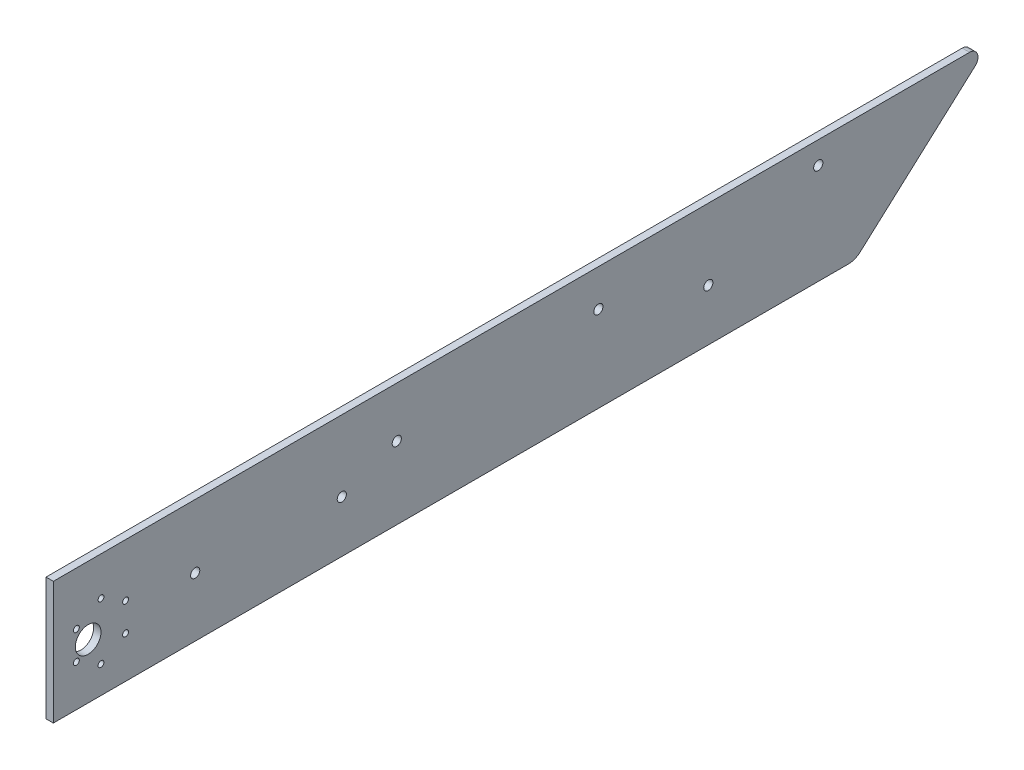
ISO-10303-21;
HEADER;
FILE_DESCRIPTION(('STEP AP214'),'2;1');
FILE_NAME('part.step','',(''),(''),'','','');
FILE_SCHEMA(('AUTOMOTIVE_DESIGN { 1 0 10303 214 1 1 1 1 }'));
ENDSEC;
DATA;
#1=APPLICATION_CONTEXT('core data for automotive mechanical design processes');
#2=APPLICATION_PROTOCOL_DEFINITION('international standard','automotive_design',2000,#1);
#3=PRODUCT_CONTEXT('',#1,'mechanical');
#4=PRODUCT('Part','Part','',(#3));
#5=PRODUCT_RELATED_PRODUCT_CATEGORY('part','',(#4));
#6=PRODUCT_DEFINITION_FORMATION('','',#4);
#7=PRODUCT_DEFINITION_CONTEXT('part definition',#1,'design');
#8=PRODUCT_DEFINITION('design','',#6,#7);
#9=PRODUCT_DEFINITION_SHAPE('','',#8);
#10=(LENGTH_UNIT() NAMED_UNIT(*) SI_UNIT(.MILLI.,.METRE.));
#11=(NAMED_UNIT(*) PLANE_ANGLE_UNIT() SI_UNIT($,.RADIAN.));
#12=(NAMED_UNIT(*) SI_UNIT($,.STERADIAN.) SOLID_ANGLE_UNIT());
#13=UNCERTAINTY_MEASURE_WITH_UNIT(LENGTH_MEASURE(1.E-05),#10,'distance_accuracy_value','');
#14=(GEOMETRIC_REPRESENTATION_CONTEXT(3) GLOBAL_UNCERTAINTY_ASSIGNED_CONTEXT((#13)) GLOBAL_UNIT_ASSIGNED_CONTEXT((#10,
#11,#12)) REPRESENTATION_CONTEXT('',''));
#15=CARTESIAN_POINT('',(0.,0.,0.));
#16=DIRECTION('',(0.,0.,1.));
#17=DIRECTION('',(1.,0.,0.));
#18=AXIS2_PLACEMENT_3D('',#15,#16,#17);
#19=CARTESIAN_POINT('',(-4.,2.59536892342969,-207.252247771588));
#20=DIRECTION('',(-1.,0.,0.));
#21=DIRECTION('',(0.,0.,1.));
#22=AXIS2_PLACEMENT_3D('',#19,#20,#21);
#23=PLANE('',#22);
#24=CARTESIAN_POINT('',(-4.,7.50688926243503,200.406668197782));
#25=DIRECTION('',(-1.,0.,0.));
#26=DIRECTION('',(0.,0.,1.));
#27=AXIS2_PLACEMENT_3D('',#24,#25,#26);
#28=CIRCLE('',#27,1.60000000000002);
#29=CARTESIAN_POINT('',(-4.,7.50688926243503,202.006668197782));
#30=VERTEX_POINT('',#29);
#31=EDGE_CURVE('E227',#30,#30,#28,.T.);
#32=ORIENTED_EDGE('',*,*,#31,.F.);
#33=EDGE_LOOP('',(#32));
#34=FACE_BOUND('',#33,.T.);
#35=CARTESIAN_POINT('',(-4.,30.7568892624349,186.983274439123));
#36=DIRECTION('',(-1.,0.,0.));
#37=DIRECTION('',(0.,0.,1.));
#38=AXIS2_PLACEMENT_3D('',#35,#36,#37);
#39=CIRCLE('',#38,1.60000000000002);
#40=CARTESIAN_POINT('',(-4.,30.7568892624349,188.583274439123));
#41=VERTEX_POINT('',#40);
#42=EDGE_CURVE('E239',#41,#41,#39,.T.);
#43=ORIENTED_EDGE('',*,*,#42,.F.);
#44=EDGE_LOOP('',(#43));
#45=FACE_BOUND('',#44,.T.);
#46=CARTESIAN_POINT('',(-4.,30.7568892624349,213.830061956441));
#47=DIRECTION('',(-1.,0.,0.));
#48=DIRECTION('',(0.,0.,1.));
#49=AXIS2_PLACEMENT_3D('',#46,#47,#48);
#50=CIRCLE('',#49,1.60000000000002);
#51=CARTESIAN_POINT('',(-4.,30.7568892624349,215.430061956441));
#52=VERTEX_POINT('',#51);
#53=EDGE_CURVE('E251',#52,#52,#50,.T.);
#54=ORIENTED_EDGE('',*,*,#53,.F.);
#55=EDGE_LOOP('',(#54));
#56=FACE_BOUND('',#55,.T.);
#57=CARTESIAN_POINT('',(-4.,20.8287481737115,68.9922577958479));
#58=DIRECTION('',(-1.,0.,0.));
#59=DIRECTION('',(0.,0.,1.));
#60=AXIS2_PLACEMENT_3D('',#57,#58,#59);
#61=CIRCLE('',#60,2.50000000000001);
#62=CARTESIAN_POINT('',(-4.,20.8287481737115,71.4922577958479));
#63=VERTEX_POINT('',#62);
#64=EDGE_CURVE('E263',#63,#63,#61,.T.);
#65=ORIENTED_EDGE('',*,*,#64,.F.);
#66=EDGE_LOOP('',(#65));
#67=FACE_BOUND('',#66,.T.);
#68=CARTESIAN_POINT('',(-4.,32.1452599847969,38.9922577958479));
#69=DIRECTION('',(-1.,0.,0.));
#70=DIRECTION('',(0.,0.,1.));
#71=AXIS2_PLACEMENT_3D('',#68,#69,#70);
#72=CIRCLE('',#71,2.5);
#73=CARTESIAN_POINT('',(-4.,32.1452599847969,41.4922577958479));
#74=VERTEX_POINT('',#73);
#75=EDGE_CURVE('E275',#74,#74,#72,.T.);
#76=ORIENTED_EDGE('',*,*,#75,.F.);
#77=EDGE_LOOP('',(#76));
#78=FACE_BOUND('',#77,.T.);
#79=CARTESIAN_POINT('',(-4.,47.4434210443393,-191.007742204152));
#80=DIRECTION('',(-1.,0.,0.));
#81=DIRECTION('',(0.,0.,1.));
#82=AXIS2_PLACEMENT_3D('',#79,#80,#81);
#83=CIRCLE('',#82,2.5);
#84=CARTESIAN_POINT('',(-4.,47.4434210443393,-188.507742204152));
#85=VERTEX_POINT('',#84);
#86=EDGE_CURVE('E287',#85,#85,#83,.T.);
#87=ORIENTED_EDGE('',*,*,#86,.F.);
#88=EDGE_LOOP('',(#87));
#89=FACE_BOUND('',#88,.T.);
#90=CARTESIAN_POINT('',(-4.,2.59536892342969,-207.252247771588));
#91=DIRECTION('',(-1.,0.,0.));
#92=DIRECTION('',(0.,0.,1.));
#93=AXIS2_PLACEMENT_3D('',#90,#91,#92);
#94=CIRCLE('',#93,10.);
#95=CARTESIAN_POINT('',(-4.,-4.83607933134426,-213.943553835177));
#96=VERTEX_POINT('',#95);
#97=CARTESIAN_POINT('',(-4.,-7.40463107657031,-207.252247771588));
#98=VERTEX_POINT('',#97);
#99=EDGE_CURVE('E131',#96,#98,#94,.T.);
#100=ORIENTED_EDGE('',*,*,#99,.T.);
#101=DIRECTION('',(0.,0.,1.));
#102=VECTOR('',#101,1.);
#103=CARTESIAN_POINT('',(-4.,-7.40463107657031,-207.252247771588));
#104=LINE('',#103,#102);
#105=CARTESIAN_POINT('',(-4.,-7.40463107657031,226.406668197782));
#106=VERTEX_POINT('',#105);
#107=EDGE_CURVE('E89',#98,#106,#104,.T.);
#108=ORIENTED_EDGE('',*,*,#107,.T.);
#109=DIRECTION('',(0.,1.,0.));
#110=VECTOR('',#109,1.);
#111=CARTESIAN_POINT('',(-4.,59.595368923429,226.406668197782));
#112=LINE('',#111,#110);
#113=CARTESIAN_POINT('',(-4.,59.595368923429,226.406668197782));
#114=VERTEX_POINT('',#113);
#115=EDGE_CURVE('E102',#106,#114,#112,.T.);
#116=ORIENTED_EDGE('',*,*,#115,.T.);
#117=DIRECTION('',(0.,0.,-1.));
#118=VECTOR('',#117,1.);
#119=CARTESIAN_POINT('',(-4.,59.595368923429,226.406668197782));
#120=LINE('',#119,#118);
#121=CARTESIAN_POINT('',(-4.,59.595368923429,-273.593331802218));
#122=VERTEX_POINT('',#121);
#123=EDGE_CURVE('E96',#114,#122,#120,.T.);
#124=ORIENTED_EDGE('',*,*,#123,.T.);
#125=CARTESIAN_POINT('',(-4.,55.0240876668013,-273.593331802218));
#126=DIRECTION('',(-1.,0.,0.));
#127=DIRECTION('',(0.,0.,1.));
#128=AXIS2_PLACEMENT_3D('',#125,#126,#127);
#129=CIRCLE('',#128,4.57128125662768);
#130=CARTESIAN_POINT('',(-4.,51.6269636551366,-276.652116001302));
#131=VERTEX_POINT('',#130);
#132=EDGE_CURVE('E100',#122,#131,#129,.T.);
#133=ORIENTED_EDGE('',*,*,#132,.T.);
#134=DIRECTION('',(0.,-0.669130606358854,0.743144825477398));
#135=VECTOR('',#134,1.);
#136=CARTESIAN_POINT('',(-4.,51.6269636551366,-276.652116001302));
#137=LINE('',#136,#135);
#138=EDGE_CURVE('E52',#131,#96,#137,.T.);
#139=ORIENTED_EDGE('',*,*,#138,.T.);
#140=EDGE_LOOP('',(#100,#108,#116,#124,#133,#139));
#141=FACE_BOUND('',#140,.T.);
#142=CARTESIAN_POINT('',(-4.,22.6022581858647,207.406668197782));
#143=DIRECTION('',(-1.,0.,0.));
#144=DIRECTION('',(0.,0.,1.));
#145=AXIS2_PLACEMENT_3D('',#142,#143,#144);
#146=CIRCLE('',#145,7.00000000000001);
#147=CARTESIAN_POINT('',(-4.,22.6022581858647,214.406668197782));
#148=VERTEX_POINT('',#147);
#149=EDGE_CURVE('E124',#148,#148,#146,.T.);
#150=ORIENTED_EDGE('',*,*,#149,.F.);
#151=EDGE_LOOP('',(#150));
#152=FACE_BOUND('',#151,.T.);
#153=CARTESIAN_POINT('',(-4.,39.4617717958825,-71.0077422041521));
#154=DIRECTION('',(-1.,0.,0.));
#155=DIRECTION('',(0.,0.,1.));
#156=AXIS2_PLACEMENT_3D('',#153,#154,#155);
#157=CIRCLE('',#156,2.5);
#158=CARTESIAN_POINT('',(-4.,39.4617717958825,-68.5077422041521));
#159=VERTEX_POINT('',#158);
#160=EDGE_CURVE('E281',#159,#159,#157,.T.);
#161=ORIENTED_EDGE('',*,*,#160,.F.);
#162=EDGE_LOOP('',(#161));
#163=FACE_BOUND('',#162,.T.);
#164=CARTESIAN_POINT('',(-4.,20.8287481737115,-131.007742204152));
#165=DIRECTION('',(-1.,0.,0.));
#166=DIRECTION('',(0.,0.,1.));
#167=AXIS2_PLACEMENT_3D('',#164,#165,#166);
#168=CIRCLE('',#167,2.5);
#169=CARTESIAN_POINT('',(-4.,20.8287481737115,-128.507742204152));
#170=VERTEX_POINT('',#169);
#171=EDGE_CURVE('E269',#170,#170,#168,.T.);
#172=ORIENTED_EDGE('',*,*,#171,.F.);
#173=EDGE_LOOP('',(#172));
#174=FACE_BOUND('',#173,.T.);
#175=CARTESIAN_POINT('',(-4.,24.8287481737115,148.992257795848));
#176=DIRECTION('',(-1.,0.,0.));
#177=DIRECTION('',(0.,0.,1.));
#178=AXIS2_PLACEMENT_3D('',#175,#176,#177);
#179=CIRCLE('',#178,2.5);
#180=CARTESIAN_POINT('',(-4.,24.8287481737115,151.492257795848));
#181=VERTEX_POINT('',#180);
#182=EDGE_CURVE('E257',#181,#181,#179,.T.);
#183=ORIENTED_EDGE('',*,*,#182,.F.);
#184=EDGE_LOOP('',(#183));
#185=FACE_BOUND('',#184,.T.);
#186=CARTESIAN_POINT('',(-4.,38.5068892624351,200.406668197782));
#187=DIRECTION('',(-1.,0.,0.));
#188=DIRECTION('',(0.,0.,1.));
#189=AXIS2_PLACEMENT_3D('',#186,#187,#188);
#190=CIRCLE('',#189,1.60000000000002);
#191=CARTESIAN_POINT('',(-4.,38.5068892624351,202.006668197782));
#192=VERTEX_POINT('',#191);
#193=EDGE_CURVE('E245',#192,#192,#190,.T.);
#194=ORIENTED_EDGE('',*,*,#193,.F.);
#195=EDGE_LOOP('',(#194));
#196=FACE_BOUND('',#195,.T.);
#197=CARTESIAN_POINT('',(-4.,15.256889262435,186.983274439123));
#198=DIRECTION('',(-1.,0.,0.));
#199=DIRECTION('',(0.,0.,1.));
#200=AXIS2_PLACEMENT_3D('',#197,#198,#199);
#201=CIRCLE('',#200,1.60000000000002);
#202=CARTESIAN_POINT('',(-4.,15.256889262435,188.583274439123));
#203=VERTEX_POINT('',#202);
#204=EDGE_CURVE('E233',#203,#203,#201,.T.);
#205=ORIENTED_EDGE('',*,*,#204,.F.);
#206=EDGE_LOOP('',(#205));
#207=FACE_BOUND('',#206,.T.);
#208=CARTESIAN_POINT('',(-4.,15.256889262435,213.830061956441));
#209=DIRECTION('',(-1.,0.,0.));
#210=DIRECTION('',(0.,0.,1.));
#211=AXIS2_PLACEMENT_3D('',#208,#209,#210);
#212=CIRCLE('',#211,1.60000000000002);
#213=CARTESIAN_POINT('',(-4.,15.256889262435,215.430061956441));
#214=VERTEX_POINT('',#213);
#215=EDGE_CURVE('E218',#214,#214,#212,.T.);
#216=ORIENTED_EDGE('',*,*,#215,.F.);
#217=EDGE_LOOP('',(#216));
#218=FACE_BOUND('',#217,.T.);
#219=ADVANCED_FACE('F35',(#34,#45,#56,#67,#78,#89,#141,#152,#163,#174,#185,#196,#207,#218),#23,.T.);
#220=CARTESIAN_POINT('',(0.,2.59536892342969,-207.252247771588));
#221=DIRECTION('',(-1.,0.,0.));
#222=DIRECTION('',(0.,0.,1.));
#223=AXIS2_PLACEMENT_3D('',#220,#221,#222);
#224=PLANE('',#223);
#225=CARTESIAN_POINT('',(0.,2.59536892342969,-207.252247771588));
#226=DIRECTION('',(-1.,0.,0.));
#227=DIRECTION('',(0.,0.,1.));
#228=AXIS2_PLACEMENT_3D('',#225,#226,#227);
#229=CIRCLE('',#228,10.);
#230=CARTESIAN_POINT('',(0.,-4.83607933134426,-213.943553835177));
#231=VERTEX_POINT('',#230);
#232=CARTESIAN_POINT('',(0.,-7.40463107657031,-207.252247771588));
#233=VERTEX_POINT('',#232);
#234=EDGE_CURVE('E120',#231,#233,#229,.T.);
#235=ORIENTED_EDGE('',*,*,#234,.F.);
#236=DIRECTION('',(0.,-0.669130606358854,0.743144825477398));
#237=VECTOR('',#236,1.);
#238=CARTESIAN_POINT('',(0.,51.6269636551366,-276.652116001302));
#239=LINE('',#238,#237);
#240=CARTESIAN_POINT('',(0.,51.6269636551366,-276.652116001302));
#241=VERTEX_POINT('',#240);
#242=EDGE_CURVE('E81',#241,#231,#239,.T.);
#243=ORIENTED_EDGE('',*,*,#242,.F.);
#244=CARTESIAN_POINT('',(0.,55.0240876668013,-273.593331802218));
#245=DIRECTION('',(-1.,0.,0.));
#246=DIRECTION('',(0.,0.,1.));
#247=AXIS2_PLACEMENT_3D('',#244,#245,#246);
#248=CIRCLE('',#247,4.57128125662768);
#249=CARTESIAN_POINT('',(0.,59.595368923429,-273.593331802218));
#250=VERTEX_POINT('',#249);
#251=EDGE_CURVE('E75',#250,#241,#248,.T.);
#252=ORIENTED_EDGE('',*,*,#251,.F.);
#253=DIRECTION('',(0.,0.,-1.));
#254=VECTOR('',#253,1.);
#255=CARTESIAN_POINT('',(0.,59.595368923429,226.406668197782));
#256=LINE('',#255,#254);
#257=CARTESIAN_POINT('',(0.,59.595368923429,226.406668197782));
#258=VERTEX_POINT('',#257);
#259=EDGE_CURVE('E110',#258,#250,#256,.T.);
#260=ORIENTED_EDGE('',*,*,#259,.F.);
#261=DIRECTION('',(0.,1.,0.));
#262=VECTOR('',#261,1.);
#263=CARTESIAN_POINT('',(0.,59.595368923429,226.406668197782));
#264=LINE('',#263,#262);
#265=CARTESIAN_POINT('',(0.,-7.40463107657031,226.406668197782));
#266=VERTEX_POINT('',#265);
#267=EDGE_CURVE('E126',#266,#258,#264,.T.);
#268=ORIENTED_EDGE('',*,*,#267,.F.);
#269=DIRECTION('',(0.,0.,1.));
#270=VECTOR('',#269,1.);
#271=CARTESIAN_POINT('',(0.,-7.40463107657031,-207.252247771588));
#272=LINE('',#271,#270);
#273=EDGE_CURVE('E123',#233,#266,#272,.T.);
#274=ORIENTED_EDGE('',*,*,#273,.F.);
#275=EDGE_LOOP('',(#235,#243,#252,#260,#268,#274));
#276=FACE_BOUND('',#275,.T.);
#277=CARTESIAN_POINT('',(0.,22.6022581858647,207.406668197782));
#278=DIRECTION('',(-1.,0.,0.));
#279=DIRECTION('',(0.,0.,1.));
#280=AXIS2_PLACEMENT_3D('',#277,#278,#279);
#281=CIRCLE('',#280,7.00000000000001);
#282=CARTESIAN_POINT('',(0.,22.6022581858647,214.406668197782));
#283=VERTEX_POINT('',#282);
#284=EDGE_CURVE('E290',#283,#283,#281,.T.);
#285=ORIENTED_EDGE('',*,*,#284,.T.);
#286=EDGE_LOOP('',(#285));
#287=FACE_BOUND('',#286,.T.);
#288=CARTESIAN_POINT('',(0.,47.4434210443393,-191.007742204152));
#289=DIRECTION('',(-1.,0.,0.));
#290=DIRECTION('',(0.,0.,1.));
#291=AXIS2_PLACEMENT_3D('',#288,#289,#290);
#292=CIRCLE('',#291,2.5);
#293=CARTESIAN_POINT('',(0.,47.4434210443393,-188.507742204152));
#294=VERTEX_POINT('',#293);
#295=EDGE_CURVE('E284',#294,#294,#292,.T.);
#296=ORIENTED_EDGE('',*,*,#295,.T.);
#297=EDGE_LOOP('',(#296));
#298=FACE_BOUND('',#297,.T.);
#299=CARTESIAN_POINT('',(0.,39.4617717958825,-71.0077422041521));
#300=DIRECTION('',(-1.,0.,0.));
#301=DIRECTION('',(0.,0.,1.));
#302=AXIS2_PLACEMENT_3D('',#299,#300,#301);
#303=CIRCLE('',#302,2.5);
#304=CARTESIAN_POINT('',(0.,39.4617717958825,-68.5077422041521));
#305=VERTEX_POINT('',#304);
#306=EDGE_CURVE('E278',#305,#305,#303,.T.);
#307=ORIENTED_EDGE('',*,*,#306,.T.);
#308=EDGE_LOOP('',(#307));
#309=FACE_BOUND('',#308,.T.);
#310=CARTESIAN_POINT('',(0.,32.1452599847969,38.9922577958479));
#311=DIRECTION('',(-1.,0.,0.));
#312=DIRECTION('',(0.,0.,1.));
#313=AXIS2_PLACEMENT_3D('',#310,#311,#312);
#314=CIRCLE('',#313,2.5);
#315=CARTESIAN_POINT('',(0.,32.1452599847969,41.4922577958479));
#316=VERTEX_POINT('',#315);
#317=EDGE_CURVE('E272',#316,#316,#314,.T.);
#318=ORIENTED_EDGE('',*,*,#317,.T.);
#319=EDGE_LOOP('',(#318));
#320=FACE_BOUND('',#319,.T.);
#321=CARTESIAN_POINT('',(0.,20.8287481737115,-131.007742204152));
#322=DIRECTION('',(-1.,0.,0.));
#323=DIRECTION('',(0.,0.,1.));
#324=AXIS2_PLACEMENT_3D('',#321,#322,#323);
#325=CIRCLE('',#324,2.5);
#326=CARTESIAN_POINT('',(0.,20.8287481737115,-128.507742204152));
#327=VERTEX_POINT('',#326);
#328=EDGE_CURVE('E266',#327,#327,#325,.T.);
#329=ORIENTED_EDGE('',*,*,#328,.T.);
#330=EDGE_LOOP('',(#329));
#331=FACE_BOUND('',#330,.T.);
#332=CARTESIAN_POINT('',(0.,20.8287481737115,68.9922577958479));
#333=DIRECTION('',(-1.,0.,0.));
#334=DIRECTION('',(0.,0.,1.));
#335=AXIS2_PLACEMENT_3D('',#332,#333,#334);
#336=CIRCLE('',#335,2.50000000000001);
#337=CARTESIAN_POINT('',(0.,20.8287481737115,71.4922577958479));
#338=VERTEX_POINT('',#337);
#339=EDGE_CURVE('E260',#338,#338,#336,.T.);
#340=ORIENTED_EDGE('',*,*,#339,.T.);
#341=EDGE_LOOP('',(#340));
#342=FACE_BOUND('',#341,.T.);
#343=CARTESIAN_POINT('',(0.,24.8287481737115,148.992257795848));
#344=DIRECTION('',(-1.,0.,0.));
#345=DIRECTION('',(0.,0.,1.));
#346=AXIS2_PLACEMENT_3D('',#343,#344,#345);
#347=CIRCLE('',#346,2.5);
#348=CARTESIAN_POINT('',(0.,24.8287481737115,151.492257795848));
#349=VERTEX_POINT('',#348);
#350=EDGE_CURVE('E254',#349,#349,#347,.T.);
#351=ORIENTED_EDGE('',*,*,#350,.T.);
#352=EDGE_LOOP('',(#351));
#353=FACE_BOUND('',#352,.T.);
#354=CARTESIAN_POINT('',(0.,30.7568892624349,213.830061956441));
#355=DIRECTION('',(-1.,0.,0.));
#356=DIRECTION('',(0.,0.,1.));
#357=AXIS2_PLACEMENT_3D('',#354,#355,#356);
#358=CIRCLE('',#357,1.60000000000002);
#359=CARTESIAN_POINT('',(0.,30.7568892624349,215.430061956441));
#360=VERTEX_POINT('',#359);
#361=EDGE_CURVE('E248',#360,#360,#358,.T.);
#362=ORIENTED_EDGE('',*,*,#361,.T.);
#363=EDGE_LOOP('',(#362));
#364=FACE_BOUND('',#363,.T.);
#365=CARTESIAN_POINT('',(0.,38.5068892624351,200.406668197782));
#366=DIRECTION('',(-1.,0.,0.));
#367=DIRECTION('',(0.,0.,1.));
#368=AXIS2_PLACEMENT_3D('',#365,#366,#367);
#369=CIRCLE('',#368,1.60000000000002);
#370=CARTESIAN_POINT('',(0.,38.5068892624351,202.006668197782));
#371=VERTEX_POINT('',#370);
#372=EDGE_CURVE('E242',#371,#371,#369,.T.);
#373=ORIENTED_EDGE('',*,*,#372,.T.);
#374=EDGE_LOOP('',(#373));
#375=FACE_BOUND('',#374,.T.);
#376=CARTESIAN_POINT('',(0.,30.7568892624349,186.983274439123));
#377=DIRECTION('',(-1.,0.,0.));
#378=DIRECTION('',(0.,0.,1.));
#379=AXIS2_PLACEMENT_3D('',#376,#377,#378);
#380=CIRCLE('',#379,1.60000000000002);
#381=CARTESIAN_POINT('',(0.,30.7568892624349,188.583274439123));
#382=VERTEX_POINT('',#381);
#383=EDGE_CURVE('E236',#382,#382,#380,.T.);
#384=ORIENTED_EDGE('',*,*,#383,.T.);
#385=EDGE_LOOP('',(#384));
#386=FACE_BOUND('',#385,.T.);
#387=CARTESIAN_POINT('',(0.,15.256889262435,186.983274439123));
#388=DIRECTION('',(-1.,0.,0.));
#389=DIRECTION('',(0.,0.,1.));
#390=AXIS2_PLACEMENT_3D('',#387,#388,#389);
#391=CIRCLE('',#390,1.60000000000002);
#392=CARTESIAN_POINT('',(0.,15.256889262435,188.583274439123));
#393=VERTEX_POINT('',#392);
#394=EDGE_CURVE('E230',#393,#393,#391,.T.);
#395=ORIENTED_EDGE('',*,*,#394,.T.);
#396=EDGE_LOOP('',(#395));
#397=FACE_BOUND('',#396,.T.);
#398=CARTESIAN_POINT('',(0.,7.50688926243503,200.406668197782));
#399=DIRECTION('',(-1.,0.,0.));
#400=DIRECTION('',(0.,0.,1.));
#401=AXIS2_PLACEMENT_3D('',#398,#399,#400);
#402=CIRCLE('',#401,1.60000000000002);
#403=CARTESIAN_POINT('',(0.,7.50688926243503,202.006668197782));
#404=VERTEX_POINT('',#403);
#405=EDGE_CURVE('E224',#404,#404,#402,.T.);
#406=ORIENTED_EDGE('',*,*,#405,.T.);
#407=EDGE_LOOP('',(#406));
#408=FACE_BOUND('',#407,.T.);
#409=CARTESIAN_POINT('',(0.,15.256889262435,213.830061956441));
#410=DIRECTION('',(-1.,0.,0.));
#411=DIRECTION('',(0.,0.,1.));
#412=AXIS2_PLACEMENT_3D('',#409,#410,#411);
#413=CIRCLE('',#412,1.60000000000002);
#414=CARTESIAN_POINT('',(0.,15.256889262435,215.430061956441));
#415=VERTEX_POINT('',#414);
#416=EDGE_CURVE('E221',#415,#415,#413,.T.);
#417=ORIENTED_EDGE('',*,*,#416,.T.);
#418=EDGE_LOOP('',(#417));
#419=FACE_BOUND('',#418,.T.);
#420=ADVANCED_FACE('F140',(#276,#287,#298,#309,#320,#331,#342,#353,#364,#375,#386,#397,#408,
#419),#224,.F.);
#421=CARTESIAN_POINT('',(-4.,2.59536892342969,-207.252247771588));
#422=DIRECTION('',(1.,0.,0.));
#423=DIRECTION('',(0.,0.,-1.));
#424=AXIS2_PLACEMENT_3D('',#421,#422,#423);
#425=CYLINDRICAL_SURFACE('',#424,10.);
#426=ORIENTED_EDGE('',*,*,#234,.T.);
#427=DIRECTION('',(1.,0.,0.));
#428=VECTOR('',#427,1.);
#429=CARTESIAN_POINT('',(-4.,-7.40463107657031,-207.252247771588));
#430=LINE('',#429,#428);
#431=EDGE_CURVE('E11',#98,#233,#430,.T.);
#432=ORIENTED_EDGE('',*,*,#431,.F.);
#433=ORIENTED_EDGE('',*,*,#99,.F.);
#434=DIRECTION('',(1.,0.,0.));
#435=VECTOR('',#434,1.);
#436=CARTESIAN_POINT('',(-4.,-4.83607933134426,-213.943553835177));
#437=LINE('',#436,#435);
#438=EDGE_CURVE('E116',#96,#231,#437,.T.);
#439=ORIENTED_EDGE('',*,*,#438,.T.);
#440=EDGE_LOOP('',(#426,#432,#433,#439));
#441=FACE_BOUND('',#440,.T.);
#442=ADVANCED_FACE('F37',(#441),#425,.T.);
#443=CARTESIAN_POINT('',(-4.,-7.40463107657031,-207.252247771588));
#444=DIRECTION('',(0.,1.,0.));
#445=DIRECTION('',(0.,0.,1.));
#446=AXIS2_PLACEMENT_3D('',#443,#444,#445);
#447=PLANE('',#446);
#448=ORIENTED_EDGE('',*,*,#273,.T.);
#449=DIRECTION('',(1.,0.,0.));
#450=VECTOR('',#449,1.);
#451=CARTESIAN_POINT('',(-4.,-7.40463107657031,226.406668197782));
#452=LINE('',#451,#450);
#453=EDGE_CURVE('E44',#106,#266,#452,.T.);
#454=ORIENTED_EDGE('',*,*,#453,.F.);
#455=ORIENTED_EDGE('',*,*,#107,.F.);
#456=ORIENTED_EDGE('',*,*,#431,.T.);
#457=EDGE_LOOP('',(#448,#454,#455,#456));
#458=FACE_BOUND('',#457,.T.);
#459=ADVANCED_FACE('F429',(#458),#447,.F.);
#460=CARTESIAN_POINT('',(-4.,59.595368923429,226.406668197782));
#461=DIRECTION('',(0.,0.,-1.));
#462=DIRECTION('',(-1.,0.,0.));
#463=AXIS2_PLACEMENT_3D('',#460,#461,#462);
#464=PLANE('',#463);
#465=ORIENTED_EDGE('',*,*,#267,.T.);
#466=DIRECTION('',(1.,0.,0.));
#467=VECTOR('',#466,1.);
#468=CARTESIAN_POINT('',(-4.,59.595368923429,226.406668197782));
#469=LINE('',#468,#467);
#470=EDGE_CURVE('E111',#114,#258,#469,.T.);
#471=ORIENTED_EDGE('',*,*,#470,.F.);
#472=ORIENTED_EDGE('',*,*,#115,.F.);
#473=ORIENTED_EDGE('',*,*,#453,.T.);
#474=EDGE_LOOP('',(#465,#471,#472,#473));
#475=FACE_BOUND('',#474,.T.);
#476=ADVANCED_FACE('F137',(#475),#464,.F.);
#477=CARTESIAN_POINT('',(-4.,59.595368923429,226.406668197782));
#478=DIRECTION('',(0.,-1.,0.));
#479=DIRECTION('',(0.,0.,-1.));
#480=AXIS2_PLACEMENT_3D('',#477,#478,#479);
#481=PLANE('',#480);
#482=ORIENTED_EDGE('',*,*,#259,.T.);
#483=DIRECTION('',(1.,0.,0.));
#484=VECTOR('',#483,1.);
#485=CARTESIAN_POINT('',(-4.,59.595368923429,-273.593331802218));
#486=LINE('',#485,#484);
#487=EDGE_CURVE('E107',#122,#250,#486,.T.);
#488=ORIENTED_EDGE('',*,*,#487,.F.);
#489=ORIENTED_EDGE('',*,*,#123,.F.);
#490=ORIENTED_EDGE('',*,*,#470,.T.);
#491=EDGE_LOOP('',(#482,#488,#489,#490));
#492=FACE_BOUND('',#491,.T.);
#493=ADVANCED_FACE('F108',(#492),#481,.F.);
#494=CARTESIAN_POINT('',(-4.,55.0240876668013,-273.593331802218));
#495=DIRECTION('',(1.,0.,0.));
#496=DIRECTION('',(0.,0.,-1.));
#497=AXIS2_PLACEMENT_3D('',#494,#495,#496);
#498=CYLINDRICAL_SURFACE('',#497,4.57128125662768);
#499=ORIENTED_EDGE('',*,*,#251,.T.);
#500=DIRECTION('',(1.,0.,0.));
#501=VECTOR('',#500,1.);
#502=CARTESIAN_POINT('',(-4.,51.6269636551366,-276.652116001302));
#503=LINE('',#502,#501);
#504=EDGE_CURVE('E112',#131,#241,#503,.T.);
#505=ORIENTED_EDGE('',*,*,#504,.F.);
#506=ORIENTED_EDGE('',*,*,#132,.F.);
#507=ORIENTED_EDGE('',*,*,#487,.T.);
#508=EDGE_LOOP('',(#499,#505,#506,#507));
#509=FACE_BOUND('',#508,.T.);
#510=ADVANCED_FACE('F114',(#509),#498,.T.);
#511=CARTESIAN_POINT('',(-4.,51.6269636551366,-276.652116001302));
#512=DIRECTION('',(0.,0.743144825477398,0.669130606358854));
#513=DIRECTION('',(0.,-0.669130606358854,0.743144825477398));
#514=AXIS2_PLACEMENT_3D('',#511,#512,#513);
#515=PLANE('',#514);
#516=ORIENTED_EDGE('',*,*,#242,.T.);
#517=ORIENTED_EDGE('',*,*,#438,.F.);
#518=ORIENTED_EDGE('',*,*,#138,.F.);
#519=ORIENTED_EDGE('',*,*,#504,.T.);
#520=EDGE_LOOP('',(#516,#517,#518,#519));
#521=FACE_BOUND('',#520,.T.);
#522=ADVANCED_FACE('F145',(#521),#515,.F.);
#523=CARTESIAN_POINT('',(-4.,22.6022581858647,207.406668197782));
#524=DIRECTION('',(1.,0.,0.));
#525=DIRECTION('',(0.,0.,-1.));
#526=AXIS2_PLACEMENT_3D('',#523,#524,#525);
#527=CYLINDRICAL_SURFACE('',#526,7.00000000000001);
#528=ORIENTED_EDGE('',*,*,#149,.T.);
#529=EDGE_LOOP('',(#528));
#530=FACE_BOUND('',#529,.T.);
#531=ORIENTED_EDGE('',*,*,#284,.F.);
#532=EDGE_LOOP('',(#531));
#533=FACE_BOUND('',#532,.T.);
#534=ADVANCED_FACE('F147',(#530,#533),#527,.F.);
#535=CARTESIAN_POINT('',(-4.,47.4434210443393,-191.007742204152));
#536=DIRECTION('',(1.,0.,0.));
#537=DIRECTION('',(0.,0.,-1.));
#538=AXIS2_PLACEMENT_3D('',#535,#536,#537);
#539=CYLINDRICAL_SURFACE('',#538,2.5);
#540=ORIENTED_EDGE('',*,*,#86,.T.);
#541=EDGE_LOOP('',(#540));
#542=FACE_BOUND('',#541,.T.);
#543=ORIENTED_EDGE('',*,*,#295,.F.);
#544=EDGE_LOOP('',(#543));
#545=FACE_BOUND('',#544,.T.);
#546=ADVANCED_FACE('F153',(#542,#545),#539,.F.);
#547=CARTESIAN_POINT('',(-4.,39.4617717958825,-71.0077422041521));
#548=DIRECTION('',(1.,0.,0.));
#549=DIRECTION('',(0.,0.,-1.));
#550=AXIS2_PLACEMENT_3D('',#547,#548,#549);
#551=CYLINDRICAL_SURFACE('',#550,2.5);
#552=ORIENTED_EDGE('',*,*,#160,.T.);
#553=EDGE_LOOP('',(#552));
#554=FACE_BOUND('',#553,.T.);
#555=ORIENTED_EDGE('',*,*,#306,.F.);
#556=EDGE_LOOP('',(#555));
#557=FACE_BOUND('',#556,.T.);
#558=ADVANCED_FACE('F169',(#554,#557),#551,.F.);
#559=CARTESIAN_POINT('',(-4.,32.1452599847969,38.9922577958479));
#560=DIRECTION('',(1.,0.,0.));
#561=DIRECTION('',(0.,0.,-1.));
#562=AXIS2_PLACEMENT_3D('',#559,#560,#561);
#563=CYLINDRICAL_SURFACE('',#562,2.5);
#564=ORIENTED_EDGE('',*,*,#75,.T.);
#565=EDGE_LOOP('',(#564));
#566=FACE_BOUND('',#565,.T.);
#567=ORIENTED_EDGE('',*,*,#317,.F.);
#568=EDGE_LOOP('',(#567));
#569=FACE_BOUND('',#568,.T.);
#570=ADVANCED_FACE('F173',(#566,#569),#563,.F.);
#571=CARTESIAN_POINT('',(-4.,20.8287481737115,-131.007742204152));
#572=DIRECTION('',(1.,0.,0.));
#573=DIRECTION('',(0.,0.,-1.));
#574=AXIS2_PLACEMENT_3D('',#571,#572,#573);
#575=CYLINDRICAL_SURFACE('',#574,2.5);
#576=ORIENTED_EDGE('',*,*,#171,.T.);
#577=EDGE_LOOP('',(#576));
#578=FACE_BOUND('',#577,.T.);
#579=ORIENTED_EDGE('',*,*,#328,.F.);
#580=EDGE_LOOP('',(#579));
#581=FACE_BOUND('',#580,.T.);
#582=ADVANCED_FACE('F177',(#578,#581),#575,.F.);
#583=CARTESIAN_POINT('',(-4.,20.8287481737115,68.9922577958479));
#584=DIRECTION('',(1.,0.,0.));
#585=DIRECTION('',(0.,0.,-1.));
#586=AXIS2_PLACEMENT_3D('',#583,#584,#585);
#587=CYLINDRICAL_SURFACE('',#586,2.50000000000001);
#588=ORIENTED_EDGE('',*,*,#64,.T.);
#589=EDGE_LOOP('',(#588));
#590=FACE_BOUND('',#589,.T.);
#591=ORIENTED_EDGE('',*,*,#339,.F.);
#592=EDGE_LOOP('',(#591));
#593=FACE_BOUND('',#592,.T.);
#594=ADVANCED_FACE('F181',(#590,#593),#587,.F.);
#595=CARTESIAN_POINT('',(-4.,24.8287481737115,148.992257795848));
#596=DIRECTION('',(1.,0.,0.));
#597=DIRECTION('',(0.,0.,-1.));
#598=AXIS2_PLACEMENT_3D('',#595,#596,#597);
#599=CYLINDRICAL_SURFACE('',#598,2.5);
#600=ORIENTED_EDGE('',*,*,#182,.T.);
#601=EDGE_LOOP('',(#600));
#602=FACE_BOUND('',#601,.T.);
#603=ORIENTED_EDGE('',*,*,#350,.F.);
#604=EDGE_LOOP('',(#603));
#605=FACE_BOUND('',#604,.T.);
#606=ADVANCED_FACE('F185',(#602,#605),#599,.F.);
#607=CARTESIAN_POINT('',(-4.,30.7568892624349,213.830061956441));
#608=DIRECTION('',(1.,0.,0.));
#609=DIRECTION('',(0.,0.,-1.));
#610=AXIS2_PLACEMENT_3D('',#607,#608,#609);
#611=CYLINDRICAL_SURFACE('',#610,1.60000000000002);
#612=ORIENTED_EDGE('',*,*,#53,.T.);
#613=EDGE_LOOP('',(#612));
#614=FACE_BOUND('',#613,.T.);
#615=ORIENTED_EDGE('',*,*,#361,.F.);
#616=EDGE_LOOP('',(#615));
#617=FACE_BOUND('',#616,.T.);
#618=ADVANCED_FACE('F189',(#614,#617),#611,.F.);
#619=CARTESIAN_POINT('',(-4.,38.5068892624351,200.406668197782));
#620=DIRECTION('',(1.,0.,0.));
#621=DIRECTION('',(0.,0.,-1.));
#622=AXIS2_PLACEMENT_3D('',#619,#620,#621);
#623=CYLINDRICAL_SURFACE('',#622,1.60000000000002);
#624=ORIENTED_EDGE('',*,*,#193,.T.);
#625=EDGE_LOOP('',(#624));
#626=FACE_BOUND('',#625,.T.);
#627=ORIENTED_EDGE('',*,*,#372,.F.);
#628=EDGE_LOOP('',(#627));
#629=FACE_BOUND('',#628,.T.);
#630=ADVANCED_FACE('F193',(#626,#629),#623,.F.);
#631=CARTESIAN_POINT('',(-4.,30.7568892624349,186.983274439123));
#632=DIRECTION('',(1.,0.,0.));
#633=DIRECTION('',(0.,0.,-1.));
#634=AXIS2_PLACEMENT_3D('',#631,#632,#633);
#635=CYLINDRICAL_SURFACE('',#634,1.60000000000002);
#636=ORIENTED_EDGE('',*,*,#42,.T.);
#637=EDGE_LOOP('',(#636));
#638=FACE_BOUND('',#637,.T.);
#639=ORIENTED_EDGE('',*,*,#383,.F.);
#640=EDGE_LOOP('',(#639));
#641=FACE_BOUND('',#640,.T.);
#642=ADVANCED_FACE('F197',(#638,#641),#635,.F.);
#643=CARTESIAN_POINT('',(-4.,15.256889262435,186.983274439123));
#644=DIRECTION('',(1.,0.,0.));
#645=DIRECTION('',(0.,0.,-1.));
#646=AXIS2_PLACEMENT_3D('',#643,#644,#645);
#647=CYLINDRICAL_SURFACE('',#646,1.60000000000002);
#648=ORIENTED_EDGE('',*,*,#204,.T.);
#649=EDGE_LOOP('',(#648));
#650=FACE_BOUND('',#649,.T.);
#651=ORIENTED_EDGE('',*,*,#394,.F.);
#652=EDGE_LOOP('',(#651));
#653=FACE_BOUND('',#652,.T.);
#654=ADVANCED_FACE('F201',(#650,#653),#647,.F.);
#655=CARTESIAN_POINT('',(-4.,7.50688926243503,200.406668197782));
#656=DIRECTION('',(1.,0.,0.));
#657=DIRECTION('',(0.,0.,-1.));
#658=AXIS2_PLACEMENT_3D('',#655,#656,#657);
#659=CYLINDRICAL_SURFACE('',#658,1.60000000000002);
#660=ORIENTED_EDGE('',*,*,#31,.T.);
#661=EDGE_LOOP('',(#660));
#662=FACE_BOUND('',#661,.T.);
#663=ORIENTED_EDGE('',*,*,#405,.F.);
#664=EDGE_LOOP('',(#663));
#665=FACE_BOUND('',#664,.T.);
#666=ADVANCED_FACE('F205',(#662,#665),#659,.F.);
#667=CARTESIAN_POINT('',(-4.,15.256889262435,213.830061956441));
#668=DIRECTION('',(1.,0.,0.));
#669=DIRECTION('',(0.,0.,-1.));
#670=AXIS2_PLACEMENT_3D('',#667,#668,#669);
#671=CYLINDRICAL_SURFACE('',#670,1.60000000000002);
#672=ORIENTED_EDGE('',*,*,#215,.T.);
#673=EDGE_LOOP('',(#672));
#674=FACE_BOUND('',#673,.T.);
#675=ORIENTED_EDGE('',*,*,#416,.F.);
#676=EDGE_LOOP('',(#675));
#677=FACE_BOUND('',#676,.T.);
#678=ADVANCED_FACE('F209',(#674,#677),#671,.F.);
#679=CLOSED_SHELL('',(#219,#420,#442,#459,#476,#493,#510,#522,#534,#546,#558,#570,#582,#594,
#606,#618,#630,#642,#654,#666,#678));
#680=MANIFOLD_SOLID_BREP('B2',#679);
#681=ADVANCED_BREP_SHAPE_REPRESENTATION('',(#18,#680),#14);
#682=SHAPE_DEFINITION_REPRESENTATION(#9,#681);
ENDSEC;
END-ISO-10303-21;
